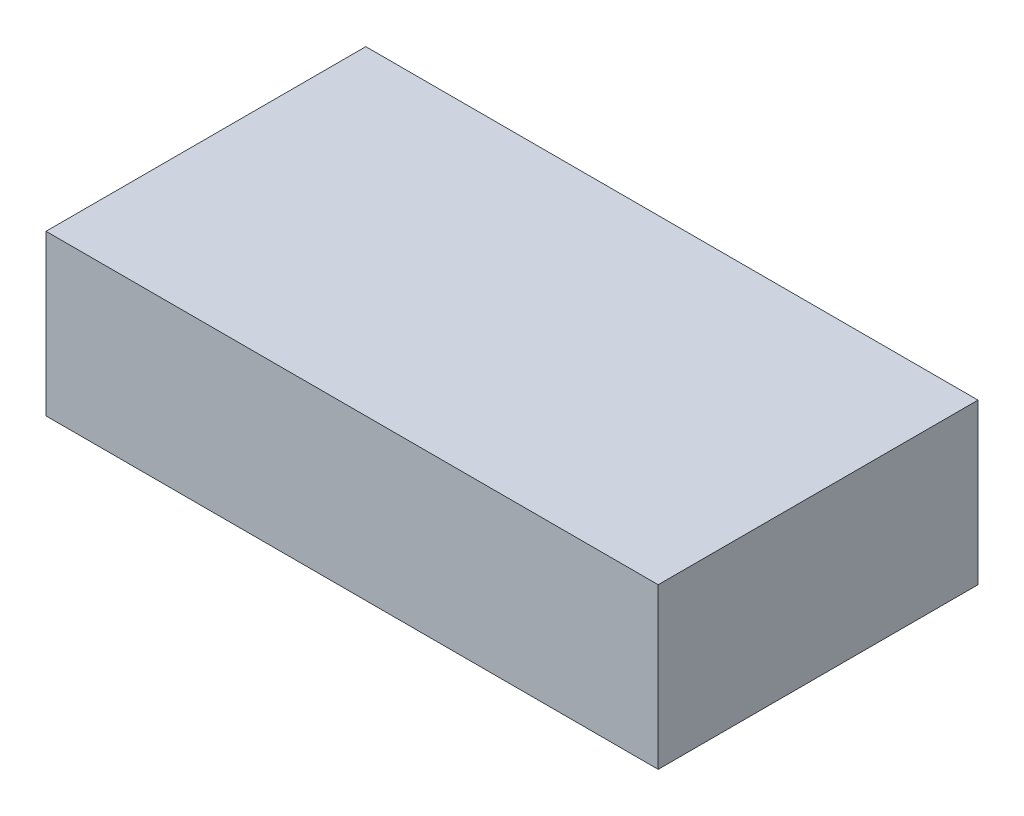
ISO-10303-21;
HEADER;
FILE_DESCRIPTION(('STEP AP214'),'2;1');
FILE_NAME('part.step','',(''),(''),'','','');
FILE_SCHEMA(('AUTOMOTIVE_DESIGN { 1 0 10303 214 1 1 1 1 }'));
ENDSEC;
DATA;
#1=APPLICATION_CONTEXT('core data for automotive mechanical design processes');
#2=APPLICATION_PROTOCOL_DEFINITION('international standard','automotive_design',2000,#1);
#3=PRODUCT_CONTEXT('',#1,'mechanical');
#4=PRODUCT('Part','Part','',(#3));
#5=PRODUCT_RELATED_PRODUCT_CATEGORY('part','',(#4));
#6=PRODUCT_DEFINITION_FORMATION('','',#4);
#7=PRODUCT_DEFINITION_CONTEXT('part definition',#1,'design');
#8=PRODUCT_DEFINITION('design','',#6,#7);
#9=PRODUCT_DEFINITION_SHAPE('','',#8);
#10=(LENGTH_UNIT() NAMED_UNIT(*) SI_UNIT(.MILLI.,.METRE.));
#11=(NAMED_UNIT(*) PLANE_ANGLE_UNIT() SI_UNIT($,.RADIAN.));
#12=(NAMED_UNIT(*) SI_UNIT($,.STERADIAN.) SOLID_ANGLE_UNIT());
#13=UNCERTAINTY_MEASURE_WITH_UNIT(LENGTH_MEASURE(1.E-05),#10,'distance_accuracy_value','');
#14=(GEOMETRIC_REPRESENTATION_CONTEXT(3) GLOBAL_UNCERTAINTY_ASSIGNED_CONTEXT((#13)) GLOBAL_UNIT_ASSIGNED_CONTEXT((#10,
#11,#12)) REPRESENTATION_CONTEXT('',''));
#15=CARTESIAN_POINT('',(0.,0.,0.));
#16=DIRECTION('',(0.,0.,1.));
#17=DIRECTION('',(1.,0.,0.));
#18=AXIS2_PLACEMENT_3D('',#15,#16,#17);
#19=CARTESIAN_POINT('',(-55.0592885375494,35.,-25.0395256916996));
#20=DIRECTION('',(1.,0.,0.));
#21=DIRECTION('',(0.,0.,-1.));
#22=AXIS2_PLACEMENT_3D('',#19,#20,#21);
#23=PLANE('',#22);
#24=DIRECTION('',(0.,0.,1.));
#25=VECTOR('',#24,1.);
#26=CARTESIAN_POINT('',(-55.0592885375494,0.,-25.0395256916996));
#27=LINE('',#26,#25);
#28=CARTESIAN_POINT('',(-55.0592885375494,0.,-25.0395256916996));
#29=VERTEX_POINT('',#28);
#30=CARTESIAN_POINT('',(-55.0592885375494,0.,44.9604743083004));
#31=VERTEX_POINT('',#30);
#32=EDGE_CURVE('E97',#29,#31,#27,.T.);
#33=ORIENTED_EDGE('',*,*,#32,.T.);
#34=DIRECTION('',(0.,-1.,0.));
#35=VECTOR('',#34,1.);
#36=CARTESIAN_POINT('',(-55.0592885375494,35.,44.9604743083004));
#37=LINE('',#36,#35);
#38=CARTESIAN_POINT('',(-55.0592885375494,35.,44.9604743083004));
#39=VERTEX_POINT('',#38);
#40=EDGE_CURVE('E11',#39,#31,#37,.T.);
#41=ORIENTED_EDGE('',*,*,#40,.F.);
#42=DIRECTION('',(0.,0.,1.));
#43=VECTOR('',#42,1.);
#44=CARTESIAN_POINT('',(-55.0592885375494,35.,-25.0395256916996));
#45=LINE('',#44,#43);
#46=CARTESIAN_POINT('',(-55.0592885375494,35.,-25.0395256916996));
#47=VERTEX_POINT('',#46);
#48=EDGE_CURVE('E85',#47,#39,#45,.T.);
#49=ORIENTED_EDGE('',*,*,#48,.F.);
#50=DIRECTION('',(0.,-1.,0.));
#51=VECTOR('',#50,1.);
#52=CARTESIAN_POINT('',(-55.0592885375494,35.,-25.0395256916996));
#53=LINE('',#52,#51);
#54=EDGE_CURVE('E93',#47,#29,#53,.T.);
#55=ORIENTED_EDGE('',*,*,#54,.T.);
#56=EDGE_LOOP('',(#33,#41,#49,#55));
#57=FACE_BOUND('',#56,.T.);
#58=ADVANCED_FACE('F34',(#57),#23,.F.);
#59=CARTESIAN_POINT('',(-55.0592885375494,35.,44.9604743083004));
#60=DIRECTION('',(0.,0.,-1.));
#61=DIRECTION('',(-1.,0.,0.));
#62=AXIS2_PLACEMENT_3D('',#59,#60,#61);
#63=PLANE('',#62);
#64=DIRECTION('',(1.,0.,0.));
#65=VECTOR('',#64,1.);
#66=CARTESIAN_POINT('',(-55.0592885375494,0.,44.9604743083004));
#67=LINE('',#66,#65);
#68=CARTESIAN_POINT('',(78.9407114624506,0.,44.9604743083004));
#69=VERTEX_POINT('',#68);
#70=EDGE_CURVE('E89',#31,#69,#67,.T.);
#71=ORIENTED_EDGE('',*,*,#70,.T.);
#72=DIRECTION('',(0.,-1.,0.));
#73=VECTOR('',#72,1.);
#74=CARTESIAN_POINT('',(78.9407114624506,35.,44.9604743083004));
#75=LINE('',#74,#73);
#76=CARTESIAN_POINT('',(78.9407114624506,35.,44.9604743083004));
#77=VERTEX_POINT('',#76);
#78=EDGE_CURVE('E42',#77,#69,#75,.T.);
#79=ORIENTED_EDGE('',*,*,#78,.F.);
#80=DIRECTION('',(1.,0.,0.));
#81=VECTOR('',#80,1.);
#82=CARTESIAN_POINT('',(-55.0592885375494,35.,44.9604743083004));
#83=LINE('',#82,#81);
#84=EDGE_CURVE('E80',#39,#77,#83,.T.);
#85=ORIENTED_EDGE('',*,*,#84,.F.);
#86=ORIENTED_EDGE('',*,*,#40,.T.);
#87=EDGE_LOOP('',(#71,#79,#85,#86));
#88=FACE_BOUND('',#87,.T.);
#89=ADVANCED_FACE('F88',(#88),#63,.F.);
#90=CARTESIAN_POINT('',(78.9407114624506,35.,-25.0395256916996));
#91=DIRECTION('',(-1.,0.,0.));
#92=DIRECTION('',(0.,0.,1.));
#93=AXIS2_PLACEMENT_3D('',#90,#91,#92);
#94=PLANE('',#93);
#95=DIRECTION('',(0.,0.,-1.));
#96=VECTOR('',#95,1.);
#97=CARTESIAN_POINT('',(78.9407114624506,0.,-25.0395256916996));
#98=LINE('',#97,#96);
#99=CARTESIAN_POINT('',(78.9407114624506,0.,-25.0395256916996));
#100=VERTEX_POINT('',#99);
#101=EDGE_CURVE('E67',#69,#100,#98,.T.);
#102=ORIENTED_EDGE('',*,*,#101,.T.);
#103=DIRECTION('',(0.,-1.,0.));
#104=VECTOR('',#103,1.);
#105=CARTESIAN_POINT('',(78.9407114624506,35.,-25.0395256916996));
#106=LINE('',#105,#104);
#107=CARTESIAN_POINT('',(78.9407114624506,35.,-25.0395256916996));
#108=VERTEX_POINT('',#107);
#109=EDGE_CURVE('E90',#108,#100,#106,.T.);
#110=ORIENTED_EDGE('',*,*,#109,.F.);
#111=DIRECTION('',(0.,0.,-1.));
#112=VECTOR('',#111,1.);
#113=CARTESIAN_POINT('',(78.9407114624506,35.,-25.0395256916996));
#114=LINE('',#113,#112);
#115=EDGE_CURVE('E83',#77,#108,#114,.T.);
#116=ORIENTED_EDGE('',*,*,#115,.F.);
#117=ORIENTED_EDGE('',*,*,#78,.T.);
#118=EDGE_LOOP('',(#102,#110,#116,#117));
#119=FACE_BOUND('',#118,.T.);
#120=ADVANCED_FACE('F91',(#119),#94,.F.);
#121=CARTESIAN_POINT('',(-55.0592885375494,35.,-25.0395256916996));
#122=DIRECTION('',(0.,0.,1.));
#123=DIRECTION('',(1.,0.,0.));
#124=AXIS2_PLACEMENT_3D('',#121,#122,#123);
#125=PLANE('',#124);
#126=DIRECTION('',(-1.,0.,0.));
#127=VECTOR('',#126,1.);
#128=CARTESIAN_POINT('',(-55.0592885375494,0.,-25.0395256916996));
#129=LINE('',#128,#127);
#130=EDGE_CURVE('E73',#100,#29,#129,.T.);
#131=ORIENTED_EDGE('',*,*,#130,.T.);
#132=ORIENTED_EDGE('',*,*,#54,.F.);
#133=DIRECTION('',(-1.,0.,0.));
#134=VECTOR('',#133,1.);
#135=CARTESIAN_POINT('',(-55.0592885375494,35.,-25.0395256916996));
#136=LINE('',#135,#134);
#137=EDGE_CURVE('E50',#108,#47,#136,.T.);
#138=ORIENTED_EDGE('',*,*,#137,.F.);
#139=ORIENTED_EDGE('',*,*,#109,.T.);
#140=EDGE_LOOP('',(#131,#132,#138,#139));
#141=FACE_BOUND('',#140,.T.);
#142=ADVANCED_FACE('F104',(#141),#125,.F.);
#143=CARTESIAN_POINT('',(0.,35.,0.));
#144=DIRECTION('',(0.,1.,0.));
#145=DIRECTION('',(0.,0.,1.));
#146=AXIS2_PLACEMENT_3D('',#143,#144,#145);
#147=PLANE('',#146);
#148=ORIENTED_EDGE('',*,*,#48,.T.);
#149=ORIENTED_EDGE('',*,*,#84,.T.);
#150=ORIENTED_EDGE('',*,*,#115,.T.);
#151=ORIENTED_EDGE('',*,*,#137,.T.);
#152=EDGE_LOOP('',(#148,#149,#150,#151));
#153=FACE_BOUND('',#152,.T.);
#154=ADVANCED_FACE('F81',(#153),#147,.T.);
#155=CARTESIAN_POINT('',(0.,0.,0.));
#156=DIRECTION('',(0.,1.,0.));
#157=DIRECTION('',(0.,0.,1.));
#158=AXIS2_PLACEMENT_3D('',#155,#156,#157);
#159=PLANE('',#158);
#160=ORIENTED_EDGE('',*,*,#32,.F.);
#161=ORIENTED_EDGE('',*,*,#130,.F.);
#162=ORIENTED_EDGE('',*,*,#101,.F.);
#163=ORIENTED_EDGE('',*,*,#70,.F.);
#164=EDGE_LOOP('',(#160,#161,#162,#163));
#165=FACE_BOUND('',#164,.T.);
#166=ADVANCED_FACE('F107',(#165),#159,.F.);
#167=CLOSED_SHELL('',(#58,#89,#120,#142,#154,#166));
#168=MANIFOLD_SOLID_BREP('B2',#167);
#169=ADVANCED_BREP_SHAPE_REPRESENTATION('',(#18,#168),#14);
#170=SHAPE_DEFINITION_REPRESENTATION(#9,#169);
ENDSEC;
END-ISO-10303-21;
